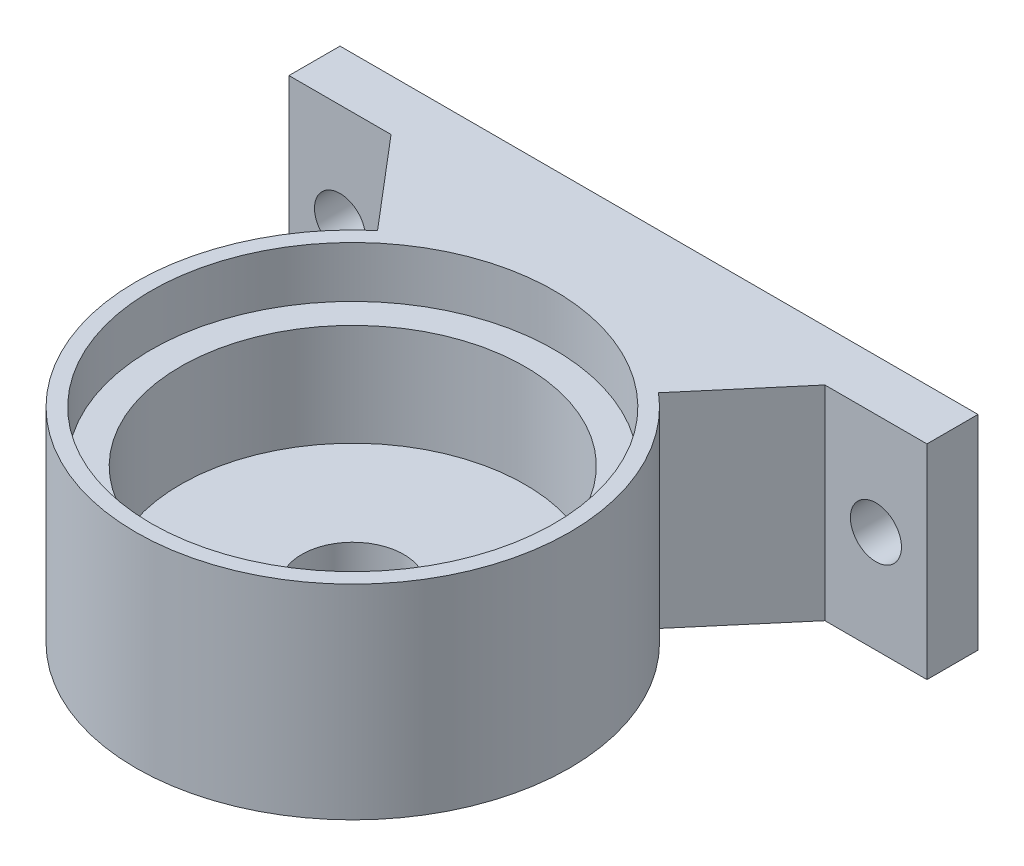
ISO-10303-21;
HEADER;
FILE_DESCRIPTION(('STEP AP214'),'2;1');
FILE_NAME('part.step','',(''),(''),'','','');
FILE_SCHEMA(('AUTOMOTIVE_DESIGN { 1 0 10303 214 1 1 1 1 }'));
ENDSEC;
DATA;
#1=APPLICATION_CONTEXT('core data for automotive mechanical design processes');
#2=APPLICATION_PROTOCOL_DEFINITION('international standard','automotive_design',2000,#1);
#3=PRODUCT_CONTEXT('',#1,'mechanical');
#4=PRODUCT('Part','Part','',(#3));
#5=PRODUCT_RELATED_PRODUCT_CATEGORY('part','',(#4));
#6=PRODUCT_DEFINITION_FORMATION('','',#4);
#7=PRODUCT_DEFINITION_CONTEXT('part definition',#1,'design');
#8=PRODUCT_DEFINITION('design','',#6,#7);
#9=PRODUCT_DEFINITION_SHAPE('','',#8);
#10=(LENGTH_UNIT() NAMED_UNIT(*) SI_UNIT(.MILLI.,.METRE.));
#11=(NAMED_UNIT(*) PLANE_ANGLE_UNIT() SI_UNIT($,.RADIAN.));
#12=(NAMED_UNIT(*) SI_UNIT($,.STERADIAN.) SOLID_ANGLE_UNIT());
#13=UNCERTAINTY_MEASURE_WITH_UNIT(LENGTH_MEASURE(1.E-05),#10,'distance_accuracy_value','');
#14=(GEOMETRIC_REPRESENTATION_CONTEXT(3) GLOBAL_UNCERTAINTY_ASSIGNED_CONTEXT((#13)) GLOBAL_UNIT_ASSIGNED_CONTEXT((#10,
#11,#12)) REPRESENTATION_CONTEXT('',''));
#15=CARTESIAN_POINT('',(0.,0.,0.));
#16=DIRECTION('',(0.,0.,1.));
#17=DIRECTION('',(1.,0.,0.));
#18=AXIS2_PLACEMENT_3D('',#15,#16,#17);
#19=CARTESIAN_POINT('',(0.,6.,0.));
#20=DIRECTION('',(0.,1.,0.));
#21=DIRECTION('',(0.,0.,1.));
#22=AXIS2_PLACEMENT_3D('',#19,#20,#21);
#23=PLANE('',#22);
#24=CARTESIAN_POINT('',(0.,6.,0.));
#25=DIRECTION('',(0.,1.,0.));
#26=DIRECTION('',(0.,0.,1.));
#27=AXIS2_PLACEMENT_3D('',#24,#25,#26);
#28=CIRCLE('',#27,7.9);
#29=CARTESIAN_POINT('',(0.,6.,7.9));
#30=VERTEX_POINT('',#29);
#31=EDGE_CURVE('E11',#30,#30,#28,.F.);
#32=ORIENTED_EDGE('',*,*,#31,.F.);
#33=EDGE_LOOP('',(#32));
#34=FACE_BOUND('',#33,.T.);
#35=CARTESIAN_POINT('',(0.,6.,0.));
#36=DIRECTION('',(0.,1.,0.));
#37=DIRECTION('',(0.,0.,1.));
#38=AXIS2_PLACEMENT_3D('',#35,#36,#37);
#39=CIRCLE('',#38,6.75);
#40=CARTESIAN_POINT('',(0.,6.,6.75));
#41=VERTEX_POINT('',#40);
#42=EDGE_CURVE('E179',#41,#41,#39,.T.);
#43=ORIENTED_EDGE('',*,*,#42,.F.);
#44=EDGE_LOOP('',(#43));
#45=FACE_BOUND('',#44,.T.);
#46=ADVANCED_FACE('F37',(#34,#45),#23,.T.);
#47=CARTESIAN_POINT('',(0.,0.,0.));
#48=DIRECTION('',(0.,1.,0.));
#49=DIRECTION('',(0.,0.,1.));
#50=AXIS2_PLACEMENT_3D('',#47,#48,#49);
#51=PLANE('',#50);
#52=CARTESIAN_POINT('',(0.,0.,0.));
#53=DIRECTION('',(0.,1.,0.));
#54=DIRECTION('',(0.,0.,1.));
#55=AXIS2_PLACEMENT_3D('',#52,#53,#54);
#56=CIRCLE('',#55,2.);
#57=CARTESIAN_POINT('',(0.,0.,2.));
#58=VERTEX_POINT('',#57);
#59=EDGE_CURVE('E175',#58,#58,#56,.T.);
#60=ORIENTED_EDGE('',*,*,#59,.T.);
#61=EDGE_LOOP('',(#60));
#62=FACE_BOUND('',#61,.T.);
#63=CARTESIAN_POINT('',(0.,0.,0.));
#64=DIRECTION('',(0.,-1.,0.));
#65=DIRECTION('',(0.,0.,-1.));
#66=AXIS2_PLACEMENT_3D('',#63,#64,#65);
#67=CIRCLE('',#66,8.5);
#68=CARTESIAN_POINT('',(5.50501157081209,0.,-6.47648420095541));
#69=VERTEX_POINT('',#68);
#70=CARTESIAN_POINT('',(-5.50501157081209,0.,-6.47648420095541));
#71=VERTEX_POINT('',#70);
#72=EDGE_CURVE('E158',#69,#71,#67,.T.);
#73=ORIENTED_EDGE('',*,*,#72,.T.);
#74=DIRECTION('',(-0.64764842009554,0.,-0.761939317759459));
#75=VECTOR('',#74,1.);
#76=CARTESIAN_POINT('',(-8.5,0.,-10.));
#77=LINE('',#76,#75);
#78=CARTESIAN_POINT('',(-8.5,0.,-10.));
#79=VERTEX_POINT('',#78);
#80=EDGE_CURVE('E139',#71,#79,#77,.T.);
#81=ORIENTED_EDGE('',*,*,#80,.T.);
#82=DIRECTION('',(-1.,0.,0.));
#83=VECTOR('',#82,1.);
#84=CARTESIAN_POINT('',(-12.5,0.,-10.));
#85=LINE('',#84,#83);
#86=CARTESIAN_POINT('',(-12.5,0.,-10.));
#87=VERTEX_POINT('',#86);
#88=EDGE_CURVE('E142',#79,#87,#85,.T.);
#89=ORIENTED_EDGE('',*,*,#88,.T.);
#90=DIRECTION('',(0.,0.,-1.));
#91=VECTOR('',#90,1.);
#92=CARTESIAN_POINT('',(-12.5,0.,-12.));
#93=LINE('',#92,#91);
#94=CARTESIAN_POINT('',(-12.5,0.,-12.));
#95=VERTEX_POINT('',#94);
#96=EDGE_CURVE('E145',#87,#95,#93,.T.);
#97=ORIENTED_EDGE('',*,*,#96,.T.);
#98=DIRECTION('',(1.,0.,0.));
#99=VECTOR('',#98,1.);
#100=CARTESIAN_POINT('',(0.,0.,-12.));
#101=LINE('',#100,#99);
#102=CARTESIAN_POINT('',(12.5,0.,-12.));
#103=VERTEX_POINT('',#102);
#104=EDGE_CURVE('E148',#95,#103,#101,.T.);
#105=ORIENTED_EDGE('',*,*,#104,.T.);
#106=DIRECTION('',(0.,0.,1.));
#107=VECTOR('',#106,1.);
#108=CARTESIAN_POINT('',(12.5,0.,-10.));
#109=LINE('',#108,#107);
#110=CARTESIAN_POINT('',(12.5,0.,-10.));
#111=VERTEX_POINT('',#110);
#112=EDGE_CURVE('E151',#103,#111,#109,.T.);
#113=ORIENTED_EDGE('',*,*,#112,.T.);
#114=DIRECTION('',(-1.,0.,0.));
#115=VECTOR('',#114,1.);
#116=CARTESIAN_POINT('',(8.5,0.,-10.));
#117=LINE('',#116,#115);
#118=CARTESIAN_POINT('',(8.5,0.,-10.));
#119=VERTEX_POINT('',#118);
#120=EDGE_CURVE('E115',#111,#119,#117,.T.);
#121=ORIENTED_EDGE('',*,*,#120,.T.);
#122=DIRECTION('',(-0.64764842009554,0.,0.761939317759459));
#123=VECTOR('',#122,1.);
#124=CARTESIAN_POINT('',(5.50501157081209,0.,-6.47648420095541));
#125=LINE('',#124,#123);
#126=EDGE_CURVE('E53',#119,#69,#125,.T.);
#127=ORIENTED_EDGE('',*,*,#126,.T.);
#128=EDGE_LOOP('',(#73,#81,#89,#97,#105,#113,#121,#127));
#129=FACE_BOUND('',#128,.T.);
#130=ADVANCED_FACE('F39',(#62,#129),#51,.F.);
#131=CARTESIAN_POINT('',(0.,6.,0.));
#132=DIRECTION('',(0.,-1.,0.));
#133=DIRECTION('',(0.,0.,-1.));
#134=AXIS2_PLACEMENT_3D('',#131,#132,#133);
#135=CYLINDRICAL_SURFACE('',#134,6.75);
#136=CARTESIAN_POINT('',(0.,2.,0.));
#137=DIRECTION('',(0.,1.,0.));
#138=DIRECTION('',(0.,0.,1.));
#139=AXIS2_PLACEMENT_3D('',#136,#137,#138);
#140=CIRCLE('',#139,6.75);
#141=CARTESIAN_POINT('',(0.,2.,6.75));
#142=VERTEX_POINT('',#141);
#143=EDGE_CURVE('E46',#142,#142,#140,.T.);
#144=ORIENTED_EDGE('',*,*,#143,.F.);
#145=EDGE_LOOP('',(#144));
#146=FACE_BOUND('',#145,.T.);
#147=ORIENTED_EDGE('',*,*,#42,.T.);
#148=EDGE_LOOP('',(#147));
#149=FACE_BOUND('',#148,.T.);
#150=ADVANCED_FACE('F190',(#146,#149),#135,.F.);
#151=CARTESIAN_POINT('',(0.,2.,0.));
#152=DIRECTION('',(0.,1.,0.));
#153=DIRECTION('',(0.,0.,1.));
#154=AXIS2_PLACEMENT_3D('',#151,#152,#153);
#155=PLANE('',#154);
#156=ORIENTED_EDGE('',*,*,#143,.T.);
#157=EDGE_LOOP('',(#156));
#158=FACE_BOUND('',#157,.T.);
#159=CARTESIAN_POINT('',(0.,2.,0.));
#160=DIRECTION('',(0.,1.,0.));
#161=DIRECTION('',(0.,0.,1.));
#162=AXIS2_PLACEMENT_3D('',#159,#160,#161);
#163=CIRCLE('',#162,2.);
#164=CARTESIAN_POINT('',(0.,2.,2.));
#165=VERTEX_POINT('',#164);
#166=EDGE_CURVE('E176',#165,#165,#163,.T.);
#167=ORIENTED_EDGE('',*,*,#166,.F.);
#168=EDGE_LOOP('',(#167));
#169=FACE_BOUND('',#168,.T.);
#170=ADVANCED_FACE('F187',(#158,#169),#155,.T.);
#171=CARTESIAN_POINT('',(0.,2.,0.));
#172=DIRECTION('',(0.,-1.,0.));
#173=DIRECTION('',(0.,0.,-1.));
#174=AXIS2_PLACEMENT_3D('',#171,#172,#173);
#175=CYLINDRICAL_SURFACE('',#174,2.);
#176=ORIENTED_EDGE('',*,*,#166,.T.);
#177=EDGE_LOOP('',(#176));
#178=FACE_BOUND('',#177,.T.);
#179=ORIENTED_EDGE('',*,*,#59,.F.);
#180=EDGE_LOOP('',(#179));
#181=FACE_BOUND('',#180,.T.);
#182=ADVANCED_FACE('F206',(#178,#181),#175,.F.);
#183=CARTESIAN_POINT('',(0.,8.,0.));
#184=DIRECTION('',(0.,1.,0.));
#185=DIRECTION('',(0.,0.,1.));
#186=AXIS2_PLACEMENT_3D('',#183,#184,#185);
#187=PLANE('',#186);
#188=CARTESIAN_POINT('',(0.,8.,0.));
#189=DIRECTION('',(0.,1.,0.));
#190=DIRECTION('',(0.,0.,1.));
#191=AXIS2_PLACEMENT_3D('',#188,#189,#190);
#192=CIRCLE('',#191,8.5);
#193=CARTESIAN_POINT('',(-5.50501157081209,8.,-6.47648420095541));
#194=VERTEX_POINT('',#193);
#195=CARTESIAN_POINT('',(5.50501157081209,8.,-6.47648420095541));
#196=VERTEX_POINT('',#195);
#197=EDGE_CURVE('E173',#194,#196,#192,.T.);
#198=ORIENTED_EDGE('',*,*,#197,.T.);
#199=DIRECTION('',(-0.64764842009554,0.,0.761939317759459));
#200=VECTOR('',#199,1.);
#201=CARTESIAN_POINT('',(5.50501157081209,8.,-6.47648420095541));
#202=LINE('',#201,#200);
#203=CARTESIAN_POINT('',(8.5,8.,-10.));
#204=VERTEX_POINT('',#203);
#205=EDGE_CURVE('E61',#204,#196,#202,.T.);
#206=ORIENTED_EDGE('',*,*,#205,.F.);
#207=DIRECTION('',(-1.,0.,0.));
#208=VECTOR('',#207,1.);
#209=CARTESIAN_POINT('',(8.5,8.,-10.));
#210=LINE('',#209,#208);
#211=CARTESIAN_POINT('',(12.5,8.,-10.));
#212=VERTEX_POINT('',#211);
#213=EDGE_CURVE('E114',#212,#204,#210,.T.);
#214=ORIENTED_EDGE('',*,*,#213,.F.);
#215=DIRECTION('',(0.,0.,1.));
#216=VECTOR('',#215,1.);
#217=CARTESIAN_POINT('',(12.5,8.,-10.));
#218=LINE('',#217,#216);
#219=CARTESIAN_POINT('',(12.5,8.,-12.));
#220=VERTEX_POINT('',#219);
#221=EDGE_CURVE('E128',#220,#212,#218,.T.);
#222=ORIENTED_EDGE('',*,*,#221,.F.);
#223=DIRECTION('',(1.,0.,0.));
#224=VECTOR('',#223,1.);
#225=CARTESIAN_POINT('',(0.,8.,-12.));
#226=LINE('',#225,#224);
#227=CARTESIAN_POINT('',(-12.5,8.,-12.));
#228=VERTEX_POINT('',#227);
#229=EDGE_CURVE('E132',#228,#220,#226,.T.);
#230=ORIENTED_EDGE('',*,*,#229,.F.);
#231=DIRECTION('',(0.,0.,-1.));
#232=VECTOR('',#231,1.);
#233=CARTESIAN_POINT('',(-12.5,8.,-12.));
#234=LINE('',#233,#232);
#235=CARTESIAN_POINT('',(-12.5,8.,-10.));
#236=VERTEX_POINT('',#235);
#237=EDGE_CURVE('E134',#236,#228,#234,.T.);
#238=ORIENTED_EDGE('',*,*,#237,.F.);
#239=DIRECTION('',(-1.,0.,0.));
#240=VECTOR('',#239,1.);
#241=CARTESIAN_POINT('',(-12.5,8.,-10.));
#242=LINE('',#241,#240);
#243=CARTESIAN_POINT('',(-8.5,8.,-10.));
#244=VERTEX_POINT('',#243);
#245=EDGE_CURVE('E266',#244,#236,#242,.T.);
#246=ORIENTED_EDGE('',*,*,#245,.F.);
#247=DIRECTION('',(-0.64764842009554,0.,-0.761939317759459));
#248=VECTOR('',#247,1.);
#249=CARTESIAN_POINT('',(-8.5,8.,-10.));
#250=LINE('',#249,#248);
#251=EDGE_CURVE('E155',#194,#244,#250,.T.);
#252=ORIENTED_EDGE('',*,*,#251,.F.);
#253=EDGE_LOOP('',(#198,#206,#214,#222,#230,#238,#246,#252));
#254=FACE_BOUND('',#253,.T.);
#255=CARTESIAN_POINT('',(0.,8.,0.));
#256=DIRECTION('',(0.,1.,0.));
#257=DIRECTION('',(0.,0.,1.));
#258=AXIS2_PLACEMENT_3D('',#255,#256,#257);
#259=CIRCLE('',#258,7.9);
#260=CARTESIAN_POINT('',(0.,8.,7.9));
#261=VERTEX_POINT('',#260);
#262=EDGE_CURVE('E170',#261,#261,#259,.T.);
#263=ORIENTED_EDGE('',*,*,#262,.F.);
#264=EDGE_LOOP('',(#263));
#265=FACE_BOUND('',#264,.T.);
#266=ADVANCED_FACE('F125',(#254,#265),#187,.T.);
#267=CARTESIAN_POINT('',(0.,8.,0.));
#268=DIRECTION('',(0.,-1.,0.));
#269=DIRECTION('',(0.,0.,-1.));
#270=AXIS2_PLACEMENT_3D('',#267,#268,#269);
#271=CYLINDRICAL_SURFACE('',#270,8.5);
#272=ORIENTED_EDGE('',*,*,#72,.F.);
#273=DIRECTION('',(0.,-1.,0.));
#274=VECTOR('',#273,1.);
#275=CARTESIAN_POINT('',(5.50501157081209,8.,-6.47648420095541));
#276=LINE('',#275,#274);
#277=EDGE_CURVE('E156',#196,#69,#276,.T.);
#278=ORIENTED_EDGE('',*,*,#277,.F.);
#279=ORIENTED_EDGE('',*,*,#197,.F.);
#280=DIRECTION('',(0.,-1.,0.));
#281=VECTOR('',#280,1.);
#282=CARTESIAN_POINT('',(-5.50501157081209,8.,-6.47648420095541));
#283=LINE('',#282,#281);
#284=EDGE_CURVE('E97',#194,#71,#283,.T.);
#285=ORIENTED_EDGE('',*,*,#284,.T.);
#286=EDGE_LOOP('',(#272,#278,#279,#285));
#287=FACE_BOUND('',#286,.T.);
#288=ADVANCED_FACE('F210',(#287),#271,.T.);
#289=CARTESIAN_POINT('',(0.,8.,0.));
#290=DIRECTION('',(0.,-1.,0.));
#291=DIRECTION('',(0.,0.,-1.));
#292=AXIS2_PLACEMENT_3D('',#289,#290,#291);
#293=CYLINDRICAL_SURFACE('',#292,7.9);
#294=ORIENTED_EDGE('',*,*,#262,.T.);
#295=EDGE_LOOP('',(#294));
#296=FACE_BOUND('',#295,.T.);
#297=ORIENTED_EDGE('',*,*,#31,.T.);
#298=EDGE_LOOP('',(#297));
#299=FACE_BOUND('',#298,.T.);
#300=ADVANCED_FACE('F213',(#296,#299),#293,.F.);
#301=CARTESIAN_POINT('',(5.50501157081209,8.,-6.47648420095541));
#302=DIRECTION('',(0.761939317759459,0.,0.64764842009554));
#303=DIRECTION('',(0.64764842009554,0.,-0.761939317759459));
#304=AXIS2_PLACEMENT_3D('',#301,#302,#303);
#305=PLANE('',#304);
#306=ORIENTED_EDGE('',*,*,#126,.F.);
#307=DIRECTION('',(0.,-1.,0.));
#308=VECTOR('',#307,1.);
#309=CARTESIAN_POINT('',(8.5,8.,-10.));
#310=LINE('',#309,#308);
#311=EDGE_CURVE('E90',#204,#119,#310,.T.);
#312=ORIENTED_EDGE('',*,*,#311,.F.);
#313=ORIENTED_EDGE('',*,*,#205,.T.);
#314=ORIENTED_EDGE('',*,*,#277,.T.);
#315=EDGE_LOOP('',(#306,#312,#313,#314));
#316=FACE_BOUND('',#315,.T.);
#317=ADVANCED_FACE('F219',(#316),#305,.T.);
#318=CARTESIAN_POINT('',(8.5,8.,-10.));
#319=DIRECTION('',(0.,0.,1.));
#320=DIRECTION('',(1.,0.,0.));
#321=AXIS2_PLACEMENT_3D('',#318,#319,#320);
#322=PLANE('',#321);
#323=CARTESIAN_POINT('',(10.5,4.,-10.));
#324=DIRECTION('',(0.,0.,1.));
#325=DIRECTION('',(1.,0.,0.));
#326=AXIS2_PLACEMENT_3D('',#323,#324,#325);
#327=CIRCLE('',#326,1.);
#328=CARTESIAN_POINT('',(11.5,4.,-10.));
#329=VERTEX_POINT('',#328);
#330=EDGE_CURVE('E255',#329,#329,#327,.T.);
#331=ORIENTED_EDGE('',*,*,#330,.F.);
#332=EDGE_LOOP('',(#331));
#333=FACE_BOUND('',#332,.T.);
#334=ORIENTED_EDGE('',*,*,#120,.F.);
#335=DIRECTION('',(0.,-1.,0.));
#336=VECTOR('',#335,1.);
#337=CARTESIAN_POINT('',(12.5,8.,-10.));
#338=LINE('',#337,#336);
#339=EDGE_CURVE('E111',#212,#111,#338,.T.);
#340=ORIENTED_EDGE('',*,*,#339,.F.);
#341=ORIENTED_EDGE('',*,*,#213,.T.);
#342=ORIENTED_EDGE('',*,*,#311,.T.);
#343=EDGE_LOOP('',(#334,#340,#341,#342));
#344=FACE_BOUND('',#343,.T.);
#345=ADVANCED_FACE('F113',(#333,#344),#322,.T.);
#346=CARTESIAN_POINT('',(12.5,8.,-10.));
#347=DIRECTION('',(1.,0.,0.));
#348=DIRECTION('',(0.,0.,-1.));
#349=AXIS2_PLACEMENT_3D('',#346,#347,#348);
#350=PLANE('',#349);
#351=ORIENTED_EDGE('',*,*,#112,.F.);
#352=DIRECTION('',(0.,-1.,0.));
#353=VECTOR('',#352,1.);
#354=CARTESIAN_POINT('',(12.5,8.,-12.));
#355=LINE('',#354,#353);
#356=EDGE_CURVE('E120',#220,#103,#355,.T.);
#357=ORIENTED_EDGE('',*,*,#356,.F.);
#358=ORIENTED_EDGE('',*,*,#221,.T.);
#359=ORIENTED_EDGE('',*,*,#339,.T.);
#360=EDGE_LOOP('',(#351,#357,#358,#359));
#361=FACE_BOUND('',#360,.T.);
#362=ADVANCED_FACE('F131',(#361),#350,.T.);
#363=CARTESIAN_POINT('',(0.,8.,-12.));
#364=DIRECTION('',(0.,0.,-1.));
#365=DIRECTION('',(-1.,0.,0.));
#366=AXIS2_PLACEMENT_3D('',#363,#364,#365);
#367=PLANE('',#366);
#368=CARTESIAN_POINT('',(10.5,4.,-12.));
#369=DIRECTION('',(0.,0.,-1.));
#370=DIRECTION('',(-1.,0.,0.));
#371=AXIS2_PLACEMENT_3D('',#368,#369,#370);
#372=CIRCLE('',#371,1.);
#373=CARTESIAN_POINT('',(9.5,4.,-12.));
#374=VERTEX_POINT('',#373);
#375=EDGE_CURVE('E258',#374,#374,#372,.T.);
#376=ORIENTED_EDGE('',*,*,#375,.F.);
#377=EDGE_LOOP('',(#376));
#378=FACE_BOUND('',#377,.T.);
#379=CARTESIAN_POINT('',(-10.5,4.,-12.));
#380=DIRECTION('',(0.,0.,-1.));
#381=DIRECTION('',(-1.,0.,0.));
#382=AXIS2_PLACEMENT_3D('',#379,#380,#381);
#383=CIRCLE('',#382,1.);
#384=CARTESIAN_POINT('',(-11.5,4.,-12.));
#385=VERTEX_POINT('',#384);
#386=EDGE_CURVE('E260',#385,#385,#383,.T.);
#387=ORIENTED_EDGE('',*,*,#386,.F.);
#388=EDGE_LOOP('',(#387));
#389=FACE_BOUND('',#388,.T.);
#390=ORIENTED_EDGE('',*,*,#104,.F.);
#391=DIRECTION('',(0.,-1.,0.));
#392=VECTOR('',#391,1.);
#393=CARTESIAN_POINT('',(-12.5,8.,-12.));
#394=LINE('',#393,#392);
#395=EDGE_CURVE('E161',#228,#95,#394,.T.);
#396=ORIENTED_EDGE('',*,*,#395,.F.);
#397=ORIENTED_EDGE('',*,*,#229,.T.);
#398=ORIENTED_EDGE('',*,*,#356,.T.);
#399=EDGE_LOOP('',(#390,#396,#397,#398));
#400=FACE_BOUND('',#399,.T.);
#401=ADVANCED_FACE('F232',(#378,#389,#400),#367,.T.);
#402=CARTESIAN_POINT('',(-12.5,8.,-12.));
#403=DIRECTION('',(-1.,0.,0.));
#404=DIRECTION('',(0.,0.,1.));
#405=AXIS2_PLACEMENT_3D('',#402,#403,#404);
#406=PLANE('',#405);
#407=ORIENTED_EDGE('',*,*,#96,.F.);
#408=DIRECTION('',(0.,-1.,0.));
#409=VECTOR('',#408,1.);
#410=CARTESIAN_POINT('',(-12.5,8.,-10.));
#411=LINE('',#410,#409);
#412=EDGE_CURVE('E164',#236,#87,#411,.T.);
#413=ORIENTED_EDGE('',*,*,#412,.F.);
#414=ORIENTED_EDGE('',*,*,#237,.T.);
#415=ORIENTED_EDGE('',*,*,#395,.T.);
#416=EDGE_LOOP('',(#407,#413,#414,#415));
#417=FACE_BOUND('',#416,.T.);
#418=ADVANCED_FACE('F228',(#417),#406,.T.);
#419=CARTESIAN_POINT('',(-12.5,8.,-10.));
#420=DIRECTION('',(0.,0.,1.));
#421=DIRECTION('',(1.,0.,0.));
#422=AXIS2_PLACEMENT_3D('',#419,#420,#421);
#423=PLANE('',#422);
#424=CARTESIAN_POINT('',(-10.5,4.,-10.));
#425=DIRECTION('',(0.,0.,1.));
#426=DIRECTION('',(1.,0.,0.));
#427=AXIS2_PLACEMENT_3D('',#424,#425,#426);
#428=CIRCLE('',#427,1.);
#429=CARTESIAN_POINT('',(-9.5,4.,-10.));
#430=VERTEX_POINT('',#429);
#431=EDGE_CURVE('E41',#430,#430,#428,.T.);
#432=ORIENTED_EDGE('',*,*,#431,.F.);
#433=EDGE_LOOP('',(#432));
#434=FACE_BOUND('',#433,.T.);
#435=ORIENTED_EDGE('',*,*,#88,.F.);
#436=DIRECTION('',(0.,-1.,0.));
#437=VECTOR('',#436,1.);
#438=CARTESIAN_POINT('',(-8.5,8.,-10.));
#439=LINE('',#438,#437);
#440=EDGE_CURVE('E166',#244,#79,#439,.T.);
#441=ORIENTED_EDGE('',*,*,#440,.F.);
#442=ORIENTED_EDGE('',*,*,#245,.T.);
#443=ORIENTED_EDGE('',*,*,#412,.T.);
#444=EDGE_LOOP('',(#435,#441,#442,#443));
#445=FACE_BOUND('',#444,.T.);
#446=ADVANCED_FACE('F225',(#434,#445),#423,.T.);
#447=CARTESIAN_POINT('',(-8.5,8.,-10.));
#448=DIRECTION('',(-0.761939317759459,0.,0.647648420095541));
#449=DIRECTION('',(0.64764842009554,0.,0.761939317759459));
#450=AXIS2_PLACEMENT_3D('',#447,#448,#449);
#451=PLANE('',#450);
#452=ORIENTED_EDGE('',*,*,#80,.F.);
#453=ORIENTED_EDGE('',*,*,#284,.F.);
#454=ORIENTED_EDGE('',*,*,#251,.T.);
#455=ORIENTED_EDGE('',*,*,#440,.T.);
#456=EDGE_LOOP('',(#452,#453,#454,#455));
#457=FACE_BOUND('',#456,.T.);
#458=ADVANCED_FACE('F221',(#457),#451,.T.);
#459=CARTESIAN_POINT('',(-10.5,4.,-4.));
#460=DIRECTION('',(0.,0.,-1.));
#461=DIRECTION('',(-1.,0.,0.));
#462=AXIS2_PLACEMENT_3D('',#459,#460,#461);
#463=CYLINDRICAL_SURFACE('',#462,1.);
#464=ORIENTED_EDGE('',*,*,#431,.T.);
#465=EDGE_LOOP('',(#464));
#466=FACE_BOUND('',#465,.T.);
#467=ORIENTED_EDGE('',*,*,#386,.T.);
#468=EDGE_LOOP('',(#467));
#469=FACE_BOUND('',#468,.T.);
#470=ADVANCED_FACE('F224',(#466,#469),#463,.F.);
#471=CARTESIAN_POINT('',(10.5,4.,-4.));
#472=DIRECTION('',(0.,0.,-1.));
#473=DIRECTION('',(-1.,0.,0.));
#474=AXIS2_PLACEMENT_3D('',#471,#472,#473);
#475=CYLINDRICAL_SURFACE('',#474,1.);
#476=ORIENTED_EDGE('',*,*,#330,.T.);
#477=EDGE_LOOP('',(#476));
#478=FACE_BOUND('',#477,.T.);
#479=ORIENTED_EDGE('',*,*,#375,.T.);
#480=EDGE_LOOP('',(#479));
#481=FACE_BOUND('',#480,.T.);
#482=ADVANCED_FACE('F246',(#478,#481),#475,.F.);
#483=CLOSED_SHELL('',(#46,#130,#150,#170,#182,#266,#288,#300,#317,#345,#362,#401,#418,#446,#458,
#470,#482));
#484=MANIFOLD_SOLID_BREP('B2',#483);
#485=ADVANCED_BREP_SHAPE_REPRESENTATION('',(#18,#484),#14);
#486=SHAPE_DEFINITION_REPRESENTATION(#9,#485);
ENDSEC;
END-ISO-10303-21;
